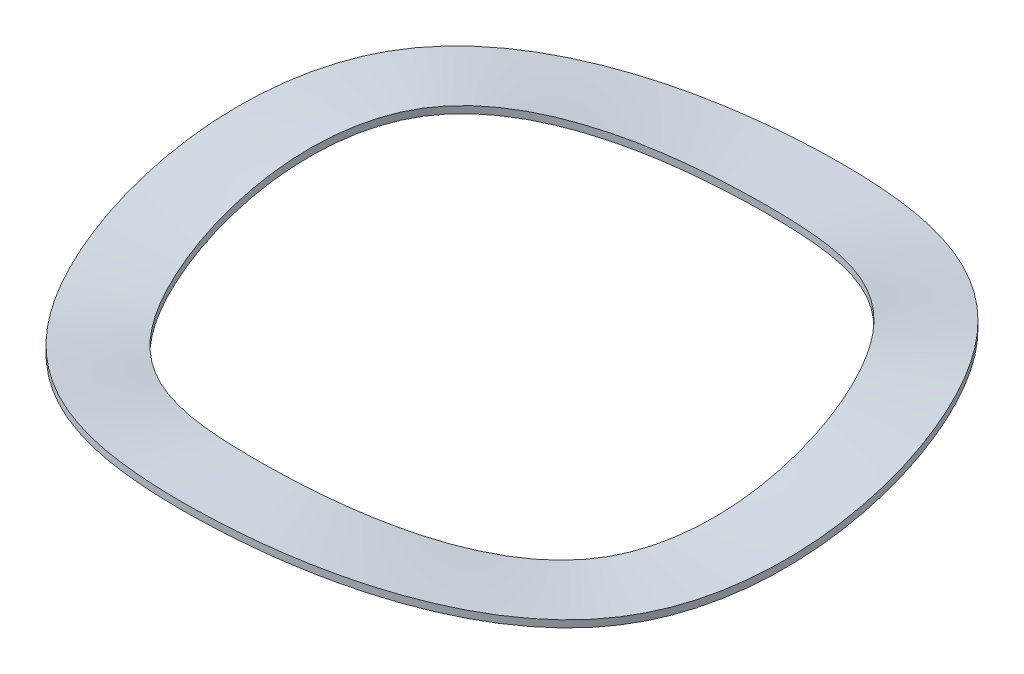
ISO-10303-21;
HEADER;
FILE_DESCRIPTION(('STEP AP214'),'2;1');
FILE_NAME('part.step','',(''),(''),'','','');
FILE_SCHEMA(('AUTOMOTIVE_DESIGN { 1 0 10303 214 1 1 1 1 }'));
ENDSEC;
DATA;
#1=APPLICATION_CONTEXT('core data for automotive mechanical design processes');
#2=APPLICATION_PROTOCOL_DEFINITION('international standard','automotive_design',2000,#1);
#3=PRODUCT_CONTEXT('',#1,'mechanical');
#4=PRODUCT('Part','Part','',(#3));
#5=PRODUCT_RELATED_PRODUCT_CATEGORY('part','',(#4));
#6=PRODUCT_DEFINITION_FORMATION('','',#4);
#7=PRODUCT_DEFINITION_CONTEXT('part definition',#1,'design');
#8=PRODUCT_DEFINITION('design','',#6,#7);
#9=PRODUCT_DEFINITION_SHAPE('','',#8);
#10=(LENGTH_UNIT() NAMED_UNIT(*) SI_UNIT(.MILLI.,.METRE.));
#11=(NAMED_UNIT(*) PLANE_ANGLE_UNIT() SI_UNIT($,.RADIAN.));
#12=(NAMED_UNIT(*) SI_UNIT($,.STERADIAN.) SOLID_ANGLE_UNIT());
#13=UNCERTAINTY_MEASURE_WITH_UNIT(LENGTH_MEASURE(1.E-05),#10,'distance_accuracy_value','');
#14=(GEOMETRIC_REPRESENTATION_CONTEXT(3) GLOBAL_UNCERTAINTY_ASSIGNED_CONTEXT((#13)) GLOBAL_UNIT_ASSIGNED_CONTEXT((#10,
#11,#12)) REPRESENTATION_CONTEXT('',''));
#15=CARTESIAN_POINT('',(0.,0.,0.));
#16=DIRECTION('',(0.,0.,1.));
#17=DIRECTION('',(1.,0.,0.));
#18=AXIS2_PLACEMENT_3D('',#15,#16,#17);
#19=CARTESIAN_POINT('',(0.,0.,-10.6553));
#20=CARTESIAN_POINT('',(3.69110419397773,0.,-10.6553));
#21=CARTESIAN_POINT('',(11.0733125819332,3.1242,-6.39318));
#22=CARTESIAN_POINT('',(11.0733125819332,-1.5621,6.39318000000003));
#23=CARTESIAN_POINT('',(0.,3.12419999999999,12.78636));
#24=CARTESIAN_POINT('',(-11.0733125819332,-1.5621,6.39317999999996));
#25=CARTESIAN_POINT('',(-11.0733125819332,1.5621,-2.13106000000005));
#26=CARTESIAN_POINT('',(-7.38220838795543,1.5621,-8.52424000000004));
#27=CARTESIAN_POINT('',(-3.69110419397772,0.,-10.6553));
#28=CARTESIAN_POINT('',(0.,0.,-10.6553));
#29=CARTESIAN_POINT('',(0.,0.,-11.6755333333333));
#30=CARTESIAN_POINT('',(4.04452338775946,0.,-11.6755333333333));
#31=CARTESIAN_POINT('',(12.1335701632784,3.1242,-7.00532));
#32=CARTESIAN_POINT('',(12.1335701632784,-1.5621,7.00532000000003));
#33=CARTESIAN_POINT('',(0.,3.1242,14.01064));
#34=CARTESIAN_POINT('',(-12.1335701632785,-1.5621,7.00531999999996));
#35=CARTESIAN_POINT('',(-12.1335701632784,1.5621,-2.33510666666672));
#36=CARTESIAN_POINT('',(-8.08904677551891,1.5621,-9.34042666666671));
#37=CARTESIAN_POINT('',(-4.04452338775946,0.,-11.6755333333333));
#38=CARTESIAN_POINT('',(0.,0.,-11.6755333333333));
#39=CARTESIAN_POINT('',(0.,0.,-12.6957666666667));
#40=CARTESIAN_POINT('',(4.3979425815412,0.,-12.6957666666667));
#41=CARTESIAN_POINT('',(13.1938277446236,3.1242,-7.61746));
#42=CARTESIAN_POINT('',(13.1938277446236,-1.5621,7.61746000000003));
#43=CARTESIAN_POINT('',(0.,3.1242,15.23492));
#44=CARTESIAN_POINT('',(-13.1938277446237,-1.5621,7.61745999999995));
#45=CARTESIAN_POINT('',(-13.1938277446236,1.5621,-2.53915333333339));
#46=CARTESIAN_POINT('',(-8.79588516308238,1.5621,-10.1566133333334));
#47=CARTESIAN_POINT('',(-4.3979425815412,0.,-12.6957666666667));
#48=CARTESIAN_POINT('',(0.,0.,-12.6957666666667));
#49=CARTESIAN_POINT('',(0.,0.,-13.716));
#50=CARTESIAN_POINT('',(4.75136177532294,0.,-13.716));
#51=CARTESIAN_POINT('',(14.2540853259689,3.1242,-8.2296));
#52=CARTESIAN_POINT('',(14.2540853259688,-1.5621,8.22960000000003));
#53=CARTESIAN_POINT('',(0.,3.1242,16.4592));
#54=CARTESIAN_POINT('',(-14.2540853259689,-1.5621,8.22959999999994));
#55=CARTESIAN_POINT('',(-14.2540853259688,1.5621,-2.74320000000006));
#56=CARTESIAN_POINT('',(-9.50272355064585,1.5621,-10.9728));
#57=CARTESIAN_POINT('',(-4.75136177532293,0.,-13.716));
#58=CARTESIAN_POINT('',(0.,0.,-13.716));
#59=B_SPLINE_SURFACE_WITH_KNOTS('',3,3,((#19,#20,#21,#22,#23,#24,#25,#26,#27,#28),(#29,#30,#31,
#32,#33,#34,#35,#36,#37,#38),(#39,#40,#41,#42,#43,#44,#45,#46,#47,#48),(#49,#50,#51,#52,#53,#54,
#55,#56,#57,#58)),.UNSPECIFIED.,.F.,.T.,.F.,(4,4),(4,1,1,1,1,2,4),(0.,1.),(0.,0.166666666666667,
0.333333333333334,0.5,0.666666666666666,0.833333333333333,1.),.UNSPECIFIED.);
#60=CARTESIAN_POINT('',(0.,0.,-13.716));
#61=CARTESIAN_POINT('',(4.75136177532294,0.,-13.716));
#62=CARTESIAN_POINT('',(14.2540853259689,3.1242,-8.2296));
#63=CARTESIAN_POINT('',(14.2540853259688,-1.5621,8.22960000000003));
#64=CARTESIAN_POINT('',(0.,3.1242,16.4592));
#65=CARTESIAN_POINT('',(-14.2540853259689,-1.5621,8.22959999999994));
#66=CARTESIAN_POINT('',(-14.2540853259688,1.5621,-2.74320000000006));
#67=CARTESIAN_POINT('',(-9.50272355064585,1.5621,-10.9728));
#68=CARTESIAN_POINT('',(-4.75136177532293,0.,-13.716));
#69=CARTESIAN_POINT('',(0.,0.,-13.716));
#70=B_SPLINE_CURVE_WITH_KNOTS('',3,(#60,#61,#62,#63,#64,#65,#66,#67,#68,#69),.UNSPECIFIED.,.T.,
.F.,(4,1,1,1,1,2,4),(0.,0.166666666666667,0.333333333333334,0.5,0.666666666666666,
0.833333333333333,1.),.UNSPECIFIED.);
#71=CARTESIAN_POINT('',(0.,0.,-13.716));
#72=VERTEX_POINT('',#71);
#73=EDGE_CURVE('E21',#72,#72,#70,.F.);
#74=CARTESIAN_POINT('',(0.,0.,-10.6553));
#75=CARTESIAN_POINT('',(3.69110419397773,0.,-10.6553));
#76=CARTESIAN_POINT('',(11.0733125819332,3.1242,-6.39318));
#77=CARTESIAN_POINT('',(11.0733125819332,-1.5621,6.39318000000003));
#78=CARTESIAN_POINT('',(0.,3.12419999999999,12.78636));
#79=CARTESIAN_POINT('',(-11.0733125819332,-1.5621,6.39317999999996));
#80=CARTESIAN_POINT('',(-11.0733125819332,1.5621,-2.13106000000005));
#81=CARTESIAN_POINT('',(-7.38220838795543,1.5621,-8.52424000000004));
#82=CARTESIAN_POINT('',(-3.69110419397772,0.,-10.6553));
#83=CARTESIAN_POINT('',(0.,0.,-10.6553));
#84=B_SPLINE_CURVE_WITH_KNOTS('',3,(#74,#75,#76,#77,#78,#79,#80,#81,#82,#83),.UNSPECIFIED.,.T.,
.F.,(4,1,1,1,1,2,4),(0.,0.166666666666667,0.333333333333334,0.5,0.666666666666666,
0.833333333333333,1.),.UNSPECIFIED.);
#85=CARTESIAN_POINT('',(0.,0.,-10.6553));
#86=VERTEX_POINT('',#85);
#87=EDGE_CURVE('E32',#86,#86,#84,.T.);
#88=ORIENTED_EDGE('',*,*,#73,.F.);
#89=EDGE_LOOP('',(#88));
#90=FACE_BOUND('',#89,.T.);
#91=ORIENTED_EDGE('',*,*,#87,.F.);
#92=EDGE_LOOP('',(#91));
#93=FACE_BOUND('',#92,.T.);
#94=ADVANCED_FACE('F15',(#90,#93),#59,.T.);
#95=CARTESIAN_POINT('',(0.,0.,-13.716));
#96=CARTESIAN_POINT('',(4.75136177532294,0.,-13.716));
#97=CARTESIAN_POINT('',(14.2540853259689,3.1242,-8.2296));
#98=CARTESIAN_POINT('',(14.2540853259688,-1.5621,8.22960000000003));
#99=CARTESIAN_POINT('',(0.,3.1242,16.4592));
#100=CARTESIAN_POINT('',(-14.2540853259689,-1.5621,8.22959999999994));
#101=CARTESIAN_POINT('',(-14.2540853259688,1.5621,-2.74320000000006));
#102=CARTESIAN_POINT('',(-9.50272355064585,1.5621,-10.9728));
#103=CARTESIAN_POINT('',(-4.75136177532293,0.,-13.716));
#104=CARTESIAN_POINT('',(0.,0.,-13.716));
#105=CARTESIAN_POINT('',(0.,0.0973666666666665,-13.716));
#106=CARTESIAN_POINT('',(4.75136177532294,0.0973666666666662,-13.716));
#107=CARTESIAN_POINT('',(14.2540853259689,3.22156666666667,-8.2296));
#108=CARTESIAN_POINT('',(14.2540853259688,-1.46473333333333,8.22960000000003));
#109=CARTESIAN_POINT('',(0.,3.22156666666666,16.4592));
#110=CARTESIAN_POINT('',(-14.2540853259689,-1.46473333333333,8.22959999999994));
#111=CARTESIAN_POINT('',(-14.2540853259688,1.65946666666666,-2.74320000000006));
#112=CARTESIAN_POINT('',(-9.50272355064585,1.65946666666667,-10.9728));
#113=CARTESIAN_POINT('',(-4.75136177532293,0.0973666666666667,-13.716));
#114=CARTESIAN_POINT('',(0.,0.0973666666666665,-13.716));
#115=CARTESIAN_POINT('',(0.,0.194733333333333,-13.716));
#116=CARTESIAN_POINT('',(4.75136177532294,0.194733333333333,-13.716));
#117=CARTESIAN_POINT('',(14.2540853259689,3.31893333333333,-8.2296));
#118=CARTESIAN_POINT('',(14.2540853259688,-1.36736666666666,8.22960000000003));
#119=CARTESIAN_POINT('',(0.,3.31893333333333,16.4592));
#120=CARTESIAN_POINT('',(-14.2540853259689,-1.36736666666667,8.22959999999994));
#121=CARTESIAN_POINT('',(-14.2540853259688,1.75683333333333,-2.74320000000006));
#122=CARTESIAN_POINT('',(-9.50272355064585,1.75683333333334,-10.9728));
#123=CARTESIAN_POINT('',(-4.75136177532293,0.194733333333333,-13.716));
#124=CARTESIAN_POINT('',(0.,0.194733333333333,-13.716));
#125=CARTESIAN_POINT('',(0.,0.292099999999999,-13.716));
#126=CARTESIAN_POINT('',(4.75136177532294,0.292099999999999,-13.716));
#127=CARTESIAN_POINT('',(14.2540853259689,3.4163,-8.2296));
#128=CARTESIAN_POINT('',(14.2540853259688,-1.27,8.22960000000003));
#129=CARTESIAN_POINT('',(0.,3.4163,16.4592));
#130=CARTESIAN_POINT('',(-14.2540853259689,-1.27,8.22959999999994));
#131=CARTESIAN_POINT('',(-14.2540853259688,1.8542,-2.74320000000006));
#132=CARTESIAN_POINT('',(-9.50272355064585,1.8542,-10.9728));
#133=CARTESIAN_POINT('',(-4.75136177532293,0.2921,-13.716));
#134=CARTESIAN_POINT('',(0.,0.292099999999999,-13.716));
#135=B_SPLINE_SURFACE_WITH_KNOTS('',3,3,((#95,#96,#97,#98,#99,#100,#101,#102,#103,#104),(#105,
#106,#107,#108,#109,#110,#111,#112,#113,#114),(#115,#116,#117,#118,#119,#120,#121,#122,#123,
#124),(#125,#126,#127,#128,#129,#130,#131,#132,#133,#134)),.UNSPECIFIED.,.F.,.T.,.F.,(4,4),(4,1,
1,1,1,2,4),(0.,1.),(0.,0.166666666666667,0.333333333333334,0.5,0.666666666666666,
0.833333333333333,1.),.UNSPECIFIED.);
#136=CARTESIAN_POINT('',(0.,0.292099999999999,-13.716));
#137=CARTESIAN_POINT('',(4.75136177532294,0.292099999999999,-13.716));
#138=CARTESIAN_POINT('',(14.2540853259689,3.4163,-8.2296));
#139=CARTESIAN_POINT('',(14.2540853259688,-1.27,8.22960000000003));
#140=CARTESIAN_POINT('',(0.,3.4163,16.4592));
#141=CARTESIAN_POINT('',(-14.2540853259689,-1.27,8.22959999999994));
#142=CARTESIAN_POINT('',(-14.2540853259688,1.8542,-2.74320000000006));
#143=CARTESIAN_POINT('',(-9.50272355064585,1.8542,-10.9728));
#144=CARTESIAN_POINT('',(-4.75136177532293,0.2921,-13.716));
#145=CARTESIAN_POINT('',(0.,0.292099999999999,-13.716));
#146=B_SPLINE_CURVE_WITH_KNOTS('',3,(#136,#137,#138,#139,#140,#141,#142,#143,#144,#145),
.UNSPECIFIED.,.T.,.F.,(4,1,1,1,1,2,4),(0.,0.166666666666667,0.333333333333334,0.5,
0.666666666666666,0.833333333333333,1.),.UNSPECIFIED.);
#147=CARTESIAN_POINT('',(0.,0.292099999999999,-13.716));
#148=VERTEX_POINT('',#147);
#149=EDGE_CURVE('E27',#148,#148,#146,.F.);
#150=ORIENTED_EDGE('',*,*,#149,.F.);
#151=EDGE_LOOP('',(#150));
#152=FACE_BOUND('',#151,.T.);
#153=ORIENTED_EDGE('',*,*,#73,.T.);
#154=EDGE_LOOP('',(#153));
#155=FACE_BOUND('',#154,.T.);
#156=ADVANCED_FACE('F55',(#152,#155),#135,.T.);
#157=CARTESIAN_POINT('',(0.,0.292099999999999,-10.6553));
#158=CARTESIAN_POINT('',(3.69110419397773,0.292099999999999,-10.6553));
#159=CARTESIAN_POINT('',(11.0733125819332,3.4163,-6.39318));
#160=CARTESIAN_POINT('',(11.0733125819332,-1.27,6.39318000000003));
#161=CARTESIAN_POINT('',(0.,3.4163,12.78636));
#162=CARTESIAN_POINT('',(-11.0733125819332,-1.27000000000001,6.39317999999996));
#163=CARTESIAN_POINT('',(-11.0733125819332,1.8542,-2.13106000000005));
#164=CARTESIAN_POINT('',(-7.38220838795543,1.8542,-8.52424000000004));
#165=CARTESIAN_POINT('',(-3.69110419397772,0.2921,-10.6553));
#166=CARTESIAN_POINT('',(0.,0.292099999999999,-10.6553));
#167=CARTESIAN_POINT('',(0.,0.194733333333333,-10.6553));
#168=CARTESIAN_POINT('',(3.69110419397773,0.194733333333332,-10.6553));
#169=CARTESIAN_POINT('',(11.0733125819332,3.31893333333334,-6.39318));
#170=CARTESIAN_POINT('',(11.0733125819332,-1.36736666666667,6.39318000000003));
#171=CARTESIAN_POINT('',(0.,3.31893333333333,12.78636));
#172=CARTESIAN_POINT('',(-11.0733125819332,-1.36736666666667,6.39317999999996));
#173=CARTESIAN_POINT('',(-11.0733125819332,1.75683333333333,-2.13106000000005));
#174=CARTESIAN_POINT('',(-7.38220838795543,1.75683333333334,-8.52424000000004));
#175=CARTESIAN_POINT('',(-3.69110419397772,0.194733333333333,-10.6553));
#176=CARTESIAN_POINT('',(0.,0.194733333333333,-10.6553));
#177=CARTESIAN_POINT('',(0.,0.0973666666666658,-10.6553));
#178=CARTESIAN_POINT('',(3.69110419397773,0.0973666666666655,-10.6553));
#179=CARTESIAN_POINT('',(11.0733125819332,3.22156666666667,-6.39318));
#180=CARTESIAN_POINT('',(11.0733125819332,-1.46473333333333,6.39318000000003));
#181=CARTESIAN_POINT('',(0.,3.22156666666666,12.78636));
#182=CARTESIAN_POINT('',(-11.0733125819332,-1.46473333333333,6.39317999999996));
#183=CARTESIAN_POINT('',(-11.0733125819332,1.65946666666666,-2.13106000000005));
#184=CARTESIAN_POINT('',(-7.38220838795543,1.65946666666667,-8.52424000000004));
#185=CARTESIAN_POINT('',(-3.69110419397772,0.0973666666666661,-10.6553));
#186=CARTESIAN_POINT('',(0.,0.0973666666666658,-10.6553));
#187=CARTESIAN_POINT('',(0.,0.,-10.6553));
#188=CARTESIAN_POINT('',(3.69110419397773,0.,-10.6553));
#189=CARTESIAN_POINT('',(11.0733125819332,3.1242,-6.39318));
#190=CARTESIAN_POINT('',(11.0733125819332,-1.5621,6.39318000000003));
#191=CARTESIAN_POINT('',(0.,3.12419999999999,12.78636));
#192=CARTESIAN_POINT('',(-11.0733125819332,-1.5621,6.39317999999996));
#193=CARTESIAN_POINT('',(-11.0733125819332,1.5621,-2.13106000000005));
#194=CARTESIAN_POINT('',(-7.38220838795543,1.5621,-8.52424000000004));
#195=CARTESIAN_POINT('',(-3.69110419397772,0.,-10.6553));
#196=CARTESIAN_POINT('',(0.,0.,-10.6553));
#197=B_SPLINE_SURFACE_WITH_KNOTS('',3,3,((#157,#158,#159,#160,#161,#162,#163,#164,#165,#166),
(#167,#168,#169,#170,#171,#172,#173,#174,#175,#176),(#177,#178,#179,#180,#181,#182,#183,#184,
#185,#186),(#187,#188,#189,#190,#191,#192,#193,#194,#195,#196)),.UNSPECIFIED.,.F.,.T.,.F.,(4,4),
(4,1,1,1,1,2,4),(0.,1.),(0.,0.166666666666667,0.333333333333334,0.5,0.666666666666666,
0.833333333333333,1.),.UNSPECIFIED.);
#198=CARTESIAN_POINT('',(0.,0.292099999999999,-10.6553));
#199=CARTESIAN_POINT('',(3.69110419397773,0.292099999999999,-10.6553));
#200=CARTESIAN_POINT('',(11.0733125819332,3.4163,-6.39318));
#201=CARTESIAN_POINT('',(11.0733125819332,-1.27,6.39318000000003));
#202=CARTESIAN_POINT('',(0.,3.4163,12.78636));
#203=CARTESIAN_POINT('',(-11.0733125819332,-1.27000000000001,6.39317999999997));
#204=CARTESIAN_POINT('',(-11.0733125819332,1.8542,-2.13106000000005));
#205=CARTESIAN_POINT('',(-7.38220838795543,1.8542,-8.52424000000004));
#206=CARTESIAN_POINT('',(-3.69110419397772,0.2921,-10.6553));
#207=CARTESIAN_POINT('',(0.,0.292099999999999,-10.6553));
#208=B_SPLINE_CURVE_WITH_KNOTS('',3,(#198,#199,#200,#201,#202,#203,#204,#205,#206,#207),
.UNSPECIFIED.,.T.,.F.,(4,1,1,1,1,2,4),(0.,0.166666666666667,0.333333333333334,0.5,
0.666666666666666,0.833333333333333,1.),.UNSPECIFIED.);
#209=CARTESIAN_POINT('',(0.,0.292099999999999,-10.6553));
#210=VERTEX_POINT('',#209);
#211=EDGE_CURVE('E10',#210,#210,#208,.T.);
#212=ORIENTED_EDGE('',*,*,#87,.T.);
#213=EDGE_LOOP('',(#212));
#214=FACE_BOUND('',#213,.T.);
#215=ORIENTED_EDGE('',*,*,#211,.F.);
#216=EDGE_LOOP('',(#215));
#217=FACE_BOUND('',#216,.T.);
#218=ADVANCED_FACE('F64',(#214,#217),#197,.T.);
#219=CARTESIAN_POINT('',(0.,0.292099999999999,-13.716));
#220=CARTESIAN_POINT('',(4.75136177532294,0.292099999999999,-13.716));
#221=CARTESIAN_POINT('',(14.2540853259689,3.4163,-8.2296));
#222=CARTESIAN_POINT('',(14.2540853259688,-1.27,8.22960000000003));
#223=CARTESIAN_POINT('',(0.,3.4163,16.4592));
#224=CARTESIAN_POINT('',(-14.2540853259689,-1.27,8.22959999999994));
#225=CARTESIAN_POINT('',(-14.2540853259688,1.8542,-2.74320000000006));
#226=CARTESIAN_POINT('',(-9.50272355064585,1.8542,-10.9728));
#227=CARTESIAN_POINT('',(-4.75136177532293,0.2921,-13.716));
#228=CARTESIAN_POINT('',(0.,0.292099999999999,-13.716));
#229=CARTESIAN_POINT('',(0.,0.292099999999999,-12.6957666666667));
#230=CARTESIAN_POINT('',(4.3979425815412,0.292099999999999,-12.6957666666667));
#231=CARTESIAN_POINT('',(13.1938277446236,3.4163,-7.61746));
#232=CARTESIAN_POINT('',(13.1938277446236,-1.27,7.61746000000003));
#233=CARTESIAN_POINT('',(0.,3.4163,15.23492));
#234=CARTESIAN_POINT('',(-13.1938277446237,-1.27,7.61745999999995));
#235=CARTESIAN_POINT('',(-13.1938277446236,1.8542,-2.53915333333339));
#236=CARTESIAN_POINT('',(-8.79588516308238,1.8542,-10.1566133333334));
#237=CARTESIAN_POINT('',(-4.3979425815412,0.2921,-12.6957666666667));
#238=CARTESIAN_POINT('',(0.,0.292099999999999,-12.6957666666667));
#239=CARTESIAN_POINT('',(0.,0.292099999999999,-11.6755333333333));
#240=CARTESIAN_POINT('',(4.04452338775947,0.292099999999998,-11.6755333333333));
#241=CARTESIAN_POINT('',(12.1335701632784,3.4163,-7.00532));
#242=CARTESIAN_POINT('',(12.1335701632784,-1.27,7.00532000000003));
#243=CARTESIAN_POINT('',(0.,3.4163,14.01064));
#244=CARTESIAN_POINT('',(-12.1335701632785,-1.27000000000001,7.00531999999996));
#245=CARTESIAN_POINT('',(-12.1335701632784,1.8542,-2.33510666666672));
#246=CARTESIAN_POINT('',(-8.08904677551891,1.8542,-9.34042666666671));
#247=CARTESIAN_POINT('',(-4.04452338775946,0.2921,-11.6755333333333));
#248=CARTESIAN_POINT('',(0.,0.292099999999999,-11.6755333333333));
#249=CARTESIAN_POINT('',(0.,0.292099999999999,-10.6553));
#250=CARTESIAN_POINT('',(3.69110419397773,0.292099999999999,-10.6553));
#251=CARTESIAN_POINT('',(11.0733125819332,3.4163,-6.39318));
#252=CARTESIAN_POINT('',(11.0733125819332,-1.27,6.39318000000003));
#253=CARTESIAN_POINT('',(0.,3.4163,12.78636));
#254=CARTESIAN_POINT('',(-11.0733125819332,-1.27000000000001,6.39317999999997));
#255=CARTESIAN_POINT('',(-11.0733125819332,1.8542,-2.13106000000005));
#256=CARTESIAN_POINT('',(-7.38220838795543,1.8542,-8.52424000000004));
#257=CARTESIAN_POINT('',(-3.69110419397772,0.2921,-10.6553));
#258=CARTESIAN_POINT('',(0.,0.292099999999999,-10.6553));
#259=B_SPLINE_SURFACE_WITH_KNOTS('',3,3,((#219,#220,#221,#222,#223,#224,#225,#226,#227,#228),
(#229,#230,#231,#232,#233,#234,#235,#236,#237,#238),(#239,#240,#241,#242,#243,#244,#245,#246,
#247,#248),(#249,#250,#251,#252,#253,#254,#255,#256,#257,#258)),.UNSPECIFIED.,.F.,.T.,.F.,(4,4),
(4,1,1,1,1,2,4),(0.,1.),(0.,0.166666666666667,0.333333333333334,0.5,0.666666666666666,
0.833333333333333,1.),.UNSPECIFIED.);
#260=ORIENTED_EDGE('',*,*,#211,.T.);
#261=EDGE_LOOP('',(#260));
#262=FACE_BOUND('',#261,.T.);
#263=ORIENTED_EDGE('',*,*,#149,.T.);
#264=EDGE_LOOP('',(#263));
#265=FACE_BOUND('',#264,.T.);
#266=ADVANCED_FACE('F17',(#262,#265),#259,.T.);
#267=CLOSED_SHELL('',(#94,#156,#218,#266));
#268=MANIFOLD_SOLID_BREP('B1',#267);
#269=ADVANCED_BREP_SHAPE_REPRESENTATION('',(#18,#268),#14);
#270=SHAPE_DEFINITION_REPRESENTATION(#9,#269);
ENDSEC;
END-ISO-10303-21;
